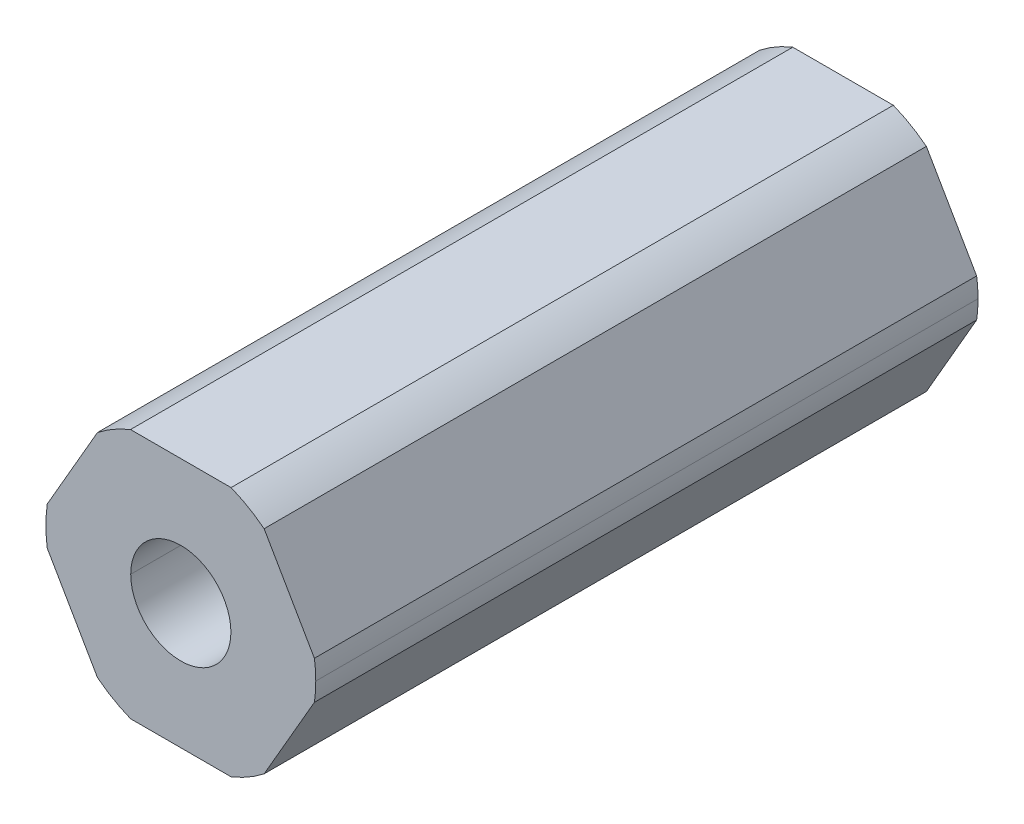
ISO-10303-21;
HEADER;
FILE_DESCRIPTION(('STEP AP214'),'2;1');
FILE_NAME('part.step','',(''),(''),'','','');
FILE_SCHEMA(('AUTOMOTIVE_DESIGN { 1 0 10303 214 1 1 1 1 }'));
ENDSEC;
DATA;
#1=APPLICATION_CONTEXT('core data for automotive mechanical design processes');
#2=APPLICATION_PROTOCOL_DEFINITION('international standard','automotive_design',2000,#1);
#3=PRODUCT_CONTEXT('',#1,'mechanical');
#4=PRODUCT('Part','Part','',(#3));
#5=PRODUCT_RELATED_PRODUCT_CATEGORY('part','',(#4));
#6=PRODUCT_DEFINITION_FORMATION('','',#4);
#7=PRODUCT_DEFINITION_CONTEXT('part definition',#1,'design');
#8=PRODUCT_DEFINITION('design','',#6,#7);
#9=PRODUCT_DEFINITION_SHAPE('','',#8);
#10=(LENGTH_UNIT() NAMED_UNIT(*) SI_UNIT(.MILLI.,.METRE.));
#11=(NAMED_UNIT(*) PLANE_ANGLE_UNIT() SI_UNIT($,.RADIAN.));
#12=(NAMED_UNIT(*) SI_UNIT($,.STERADIAN.) SOLID_ANGLE_UNIT());
#13=UNCERTAINTY_MEASURE_WITH_UNIT(LENGTH_MEASURE(1.E-05),#10,'distance_accuracy_value','');
#14=(GEOMETRIC_REPRESENTATION_CONTEXT(3) GLOBAL_UNCERTAINTY_ASSIGNED_CONTEXT((#13)) GLOBAL_UNIT_ASSIGNED_CONTEXT((#10,
#11,#12)) REPRESENTATION_CONTEXT('',''));
#15=CARTESIAN_POINT('',(0.,0.,0.));
#16=DIRECTION('',(0.,0.,1.));
#17=DIRECTION('',(1.,0.,0.));
#18=AXIS2_PLACEMENT_3D('',#15,#16,#17);
#19=CARTESIAN_POINT('',(0.,0.,-228.6));
#20=DIRECTION('',(0.,0.,1.));
#21=DIRECTION('',(1.,0.,0.));
#22=AXIS2_PLACEMENT_3D('',#19,#20,#21);
#23=CYLINDRICAL_SURFACE('',#22,2.55);
#24=DIRECTION('',(0.,0.,1.));
#25=VECTOR('',#24,1.);
#26=CARTESIAN_POINT('',(-2.55,0.,-228.6));
#27=LINE('',#26,#25);
#28=CARTESIAN_POINT('',(-2.55,0.,-228.6));
#29=VERTEX_POINT('',#28);
#30=CARTESIAN_POINT('',(-2.55,0.,-194.88785));
#31=VERTEX_POINT('',#30);
#32=EDGE_CURVE('E46',#29,#31,#27,.T.);
#33=ORIENTED_EDGE('',*,*,#32,.T.);
#34=CARTESIAN_POINT('',(0.,0.,-194.88785));
#35=DIRECTION('',(0.,0.,-1.));
#36=DIRECTION('',(-1.,0.,0.));
#37=AXIS2_PLACEMENT_3D('',#34,#35,#36);
#38=CIRCLE('',#37,2.55);
#39=CARTESIAN_POINT('',(2.55,0.,-194.88785));
#40=VERTEX_POINT('',#39);
#41=EDGE_CURVE('E60',#31,#40,#38,.F.);
#42=ORIENTED_EDGE('',*,*,#41,.T.);
#43=DIRECTION('',(0.,0.,1.));
#44=VECTOR('',#43,1.);
#45=CARTESIAN_POINT('',(2.55,0.,-228.6));
#46=LINE('',#45,#44);
#47=CARTESIAN_POINT('',(2.55,0.,-228.6));
#48=VERTEX_POINT('',#47);
#49=EDGE_CURVE('E192',#48,#40,#46,.T.);
#50=ORIENTED_EDGE('',*,*,#49,.F.);
#51=CARTESIAN_POINT('',(0.,0.,-228.6));
#52=DIRECTION('',(0.,0.,1.));
#53=DIRECTION('',(1.,0.,0.));
#54=AXIS2_PLACEMENT_3D('',#51,#52,#53);
#55=CIRCLE('',#54,2.55);
#56=EDGE_CURVE('E245',#29,#48,#55,.T.);
#57=ORIENTED_EDGE('',*,*,#56,.F.);
#58=EDGE_LOOP('',(#33,#42,#50,#57));
#59=FACE_BOUND('',#58,.T.);
#60=ADVANCED_FACE('F38',(#59),#23,.F.);
#61=CARTESIAN_POINT('',(0.,0.,-228.6));
#62=DIRECTION('',(0.,0.,1.));
#63=DIRECTION('',(1.,0.,0.));
#64=AXIS2_PLACEMENT_3D('',#61,#62,#63);
#65=CYLINDRICAL_SURFACE('',#64,6.87);
#66=CARTESIAN_POINT('',(0.,0.,-194.88785));
#67=DIRECTION('',(0.,0.,-1.));
#68=DIRECTION('',(-1.,0.,0.));
#69=AXIS2_PLACEMENT_3D('',#66,#67,#68);
#70=CIRCLE('',#69,6.87);
#71=CARTESIAN_POINT('',(6.80102150534208,-0.971085209378956,-194.88785));
#72=VERTEX_POINT('',#71);
#73=CARTESIAN_POINT('',(6.87,0.,-194.88785));
#74=VERTEX_POINT('',#73);
#75=EDGE_CURVE('E160',#72,#74,#70,.F.);
#76=ORIENTED_EDGE('',*,*,#75,.F.);
#77=DIRECTION('',(0.,0.,-1.));
#78=VECTOR('',#77,1.);
#79=CARTESIAN_POINT('',(6.80102150534208,-0.971085209378962,-228.6));
#80=LINE('',#79,#78);
#81=CARTESIAN_POINT('',(6.80102150534208,-0.971085209378955,-228.6));
#82=VERTEX_POINT('',#81);
#83=EDGE_CURVE('E173',#72,#82,#80,.T.);
#84=ORIENTED_EDGE('',*,*,#83,.T.);
#85=CARTESIAN_POINT('',(0.,0.,-228.6));
#86=DIRECTION('',(0.,0.,1.));
#87=DIRECTION('',(1.,0.,0.));
#88=AXIS2_PLACEMENT_3D('',#85,#86,#87);
#89=CIRCLE('',#88,6.87);
#90=CARTESIAN_POINT('',(6.87,0.,-228.6));
#91=VERTEX_POINT('',#90);
#92=EDGE_CURVE('E183',#82,#91,#89,.T.);
#93=ORIENTED_EDGE('',*,*,#92,.T.);
#94=DIRECTION('',(0.,0.,1.));
#95=VECTOR('',#94,1.);
#96=CARTESIAN_POINT('',(6.87,0.,-228.6));
#97=LINE('',#96,#95);
#98=EDGE_CURVE('E175',#91,#74,#97,.T.);
#99=ORIENTED_EDGE('',*,*,#98,.T.);
#100=EDGE_LOOP('',(#76,#84,#93,#99));
#101=FACE_BOUND('',#100,.T.);
#102=ADVANCED_FACE('F171',(#101),#65,.T.);
#103=CARTESIAN_POINT('',(3.68083890619154,-6.3754,228.6));
#104=DIRECTION('',(-0.866025403784439,0.5,0.));
#105=DIRECTION('',(0.,0.,1.));
#106=AXIS2_PLACEMENT_3D('',#103,#104,#105);
#107=PLANE('',#106);
#108=ORIENTED_EDGE('',*,*,#83,.F.);
#109=DIRECTION('',(0.500000000000001,0.866025403784438,0.));
#110=VECTOR('',#109,1.);
#111=CARTESIAN_POINT('',(4.24149521323254,-5.40431479062105,-194.88785));
#112=LINE('',#111,#110);
#113=CARTESIAN_POINT('',(4.24149521323254,-5.40431479062105,-194.88785));
#114=VERTEX_POINT('',#113);
#115=EDGE_CURVE('E157',#114,#72,#112,.T.);
#116=ORIENTED_EDGE('',*,*,#115,.F.);
#117=DIRECTION('',(0.,0.,1.));
#118=VECTOR('',#117,1.);
#119=CARTESIAN_POINT('',(4.24149521323255,-5.40431479062104,-228.6));
#120=LINE('',#119,#118);
#121=CARTESIAN_POINT('',(4.24149521323254,-5.40431479062105,-228.6));
#122=VERTEX_POINT('',#121);
#123=EDGE_CURVE('E244',#122,#114,#120,.T.);
#124=ORIENTED_EDGE('',*,*,#123,.F.);
#125=DIRECTION('',(0.5,0.866025403784439,0.));
#126=VECTOR('',#125,1.);
#127=CARTESIAN_POINT('',(3.68083890619154,-6.3754,-228.6));
#128=LINE('',#127,#126);
#129=EDGE_CURVE('E180',#122,#82,#128,.T.);
#130=ORIENTED_EDGE('',*,*,#129,.T.);
#131=EDGE_LOOP('',(#108,#116,#124,#130));
#132=FACE_BOUND('',#131,.T.);
#133=ADVANCED_FACE('F178',(#132),#107,.F.);
#134=CARTESIAN_POINT('',(7.36167781238308,0.,228.6));
#135=DIRECTION('',(-0.866025403784439,-0.5,0.));
#136=DIRECTION('',(-0.5,0.866025403784439,0.));
#137=AXIS2_PLACEMENT_3D('',#134,#135,#136);
#138=PLANE('',#137);
#139=DIRECTION('',(0.,0.,-1.));
#140=VECTOR('',#139,1.);
#141=CARTESIAN_POINT('',(4.24149521323254,5.40431479062105,-228.6));
#142=LINE('',#141,#140);
#143=CARTESIAN_POINT('',(4.24149521323254,5.40431479062105,-194.88785));
#144=VERTEX_POINT('',#143);
#145=CARTESIAN_POINT('',(4.24149521323254,5.40431479062105,-228.6));
#146=VERTEX_POINT('',#145);
#147=EDGE_CURVE('E211',#144,#146,#142,.T.);
#148=ORIENTED_EDGE('',*,*,#147,.F.);
#149=DIRECTION('',(-0.5,0.866025403784439,0.));
#150=VECTOR('',#149,1.);
#151=CARTESIAN_POINT('',(6.80102150534208,0.97108520937895,-194.88785));
#152=LINE('',#151,#150);
#153=CARTESIAN_POINT('',(6.80102150534208,0.97108520937895,-194.88785));
#154=VERTEX_POINT('',#153);
#155=EDGE_CURVE('E53',#154,#144,#152,.T.);
#156=ORIENTED_EDGE('',*,*,#155,.F.);
#157=DIRECTION('',(0.,0.,1.));
#158=VECTOR('',#157,1.);
#159=CARTESIAN_POINT('',(6.80102150534208,0.971085209378949,-228.6));
#160=LINE('',#159,#158);
#161=CARTESIAN_POINT('',(6.80102150534208,0.97108520937895,-228.6));
#162=VERTEX_POINT('',#161);
#163=EDGE_CURVE('E239',#162,#154,#160,.T.);
#164=ORIENTED_EDGE('',*,*,#163,.F.);
#165=DIRECTION('',(-0.5,0.866025403784439,0.));
#166=VECTOR('',#165,1.);
#167=CARTESIAN_POINT('',(7.36167781238308,0.,-228.6));
#168=LINE('',#167,#166);
#169=EDGE_CURVE('E186',#162,#146,#168,.T.);
#170=ORIENTED_EDGE('',*,*,#169,.T.);
#171=EDGE_LOOP('',(#148,#156,#164,#170));
#172=FACE_BOUND('',#171,.T.);
#173=ADVANCED_FACE('F361',(#172),#138,.F.);
#174=CARTESIAN_POINT('',(3.68083890619154,6.3754,228.6));
#175=DIRECTION('',(0.,-1.,0.));
#176=DIRECTION('',(0.,0.,-1.));
#177=AXIS2_PLACEMENT_3D('',#174,#175,#176);
#178=PLANE('',#177);
#179=DIRECTION('',(0.,0.,-1.));
#180=VECTOR('',#179,1.);
#181=CARTESIAN_POINT('',(-2.55952629210953,6.3754,-228.6));
#182=LINE('',#181,#180);
#183=CARTESIAN_POINT('',(-2.55952629210953,6.3754,-194.88785));
#184=VERTEX_POINT('',#183);
#185=CARTESIAN_POINT('',(-2.55952629210953,6.3754,-228.6));
#186=VERTEX_POINT('',#185);
#187=EDGE_CURVE('E209',#184,#186,#182,.T.);
#188=ORIENTED_EDGE('',*,*,#187,.F.);
#189=DIRECTION('',(-1.,0.,0.));
#190=VECTOR('',#189,1.);
#191=CARTESIAN_POINT('',(2.55952629210953,6.3754,-194.88785));
#192=LINE('',#191,#190);
#193=CARTESIAN_POINT('',(2.55952629210953,6.3754,-194.88785));
#194=VERTEX_POINT('',#193);
#195=EDGE_CURVE('E314',#194,#184,#192,.T.);
#196=ORIENTED_EDGE('',*,*,#195,.F.);
#197=DIRECTION('',(0.,0.,1.));
#198=VECTOR('',#197,1.);
#199=CARTESIAN_POINT('',(2.55952629210952,6.3754,-228.6));
#200=LINE('',#199,#198);
#201=CARTESIAN_POINT('',(2.55952629210952,6.3754,-228.6));
#202=VERTEX_POINT('',#201);
#203=EDGE_CURVE('E196',#202,#194,#200,.T.);
#204=ORIENTED_EDGE('',*,*,#203,.F.);
#205=DIRECTION('',(-1.,0.,0.));
#206=VECTOR('',#205,1.);
#207=CARTESIAN_POINT('',(3.68083890619154,6.3754,-228.6));
#208=LINE('',#207,#206);
#209=EDGE_CURVE('E202',#202,#186,#208,.T.);
#210=ORIENTED_EDGE('',*,*,#209,.T.);
#211=EDGE_LOOP('',(#188,#196,#204,#210));
#212=FACE_BOUND('',#211,.T.);
#213=ADVANCED_FACE('F334',(#212),#178,.F.);
#214=CARTESIAN_POINT('',(-3.68083890619154,6.3754,228.6));
#215=DIRECTION('',(0.866025403784439,-0.5,0.));
#216=DIRECTION('',(0.,0.,-1.));
#217=AXIS2_PLACEMENT_3D('',#214,#215,#216);
#218=PLANE('',#217);
#219=DIRECTION('',(0.,0.,-1.));
#220=VECTOR('',#219,1.);
#221=CARTESIAN_POINT('',(-6.80102150534208,0.97108520937896,-228.6));
#222=LINE('',#221,#220);
#223=CARTESIAN_POINT('',(-6.80102150534208,0.97108520937896,-194.88785));
#224=VERTEX_POINT('',#223);
#225=CARTESIAN_POINT('',(-6.80102150534208,0.97108520937896,-228.6));
#226=VERTEX_POINT('',#225);
#227=EDGE_CURVE('E255',#224,#226,#222,.T.);
#228=ORIENTED_EDGE('',*,*,#227,.F.);
#229=DIRECTION('',(-0.5,-0.866025403784438,0.));
#230=VECTOR('',#229,1.);
#231=CARTESIAN_POINT('',(-4.24149521323255,5.40431479062105,-194.88785));
#232=LINE('',#231,#230);
#233=CARTESIAN_POINT('',(-4.24149521323254,5.40431479062105,-194.88785));
#234=VERTEX_POINT('',#233);
#235=EDGE_CURVE('E310',#234,#224,#232,.T.);
#236=ORIENTED_EDGE('',*,*,#235,.F.);
#237=DIRECTION('',(0.,0.,1.));
#238=VECTOR('',#237,1.);
#239=CARTESIAN_POINT('',(-4.24149521323255,5.40431479062105,-228.6));
#240=LINE('',#239,#238);
#241=CARTESIAN_POINT('',(-4.24149521323255,5.40431479062105,-228.6));
#242=VERTEX_POINT('',#241);
#243=EDGE_CURVE('E210',#242,#234,#240,.T.);
#244=ORIENTED_EDGE('',*,*,#243,.F.);
#245=DIRECTION('',(-0.5,-0.866025403784439,0.));
#246=VECTOR('',#245,1.);
#247=CARTESIAN_POINT('',(-3.68083890619154,6.3754,-228.6));
#248=LINE('',#247,#246);
#249=EDGE_CURVE('E199',#242,#226,#248,.T.);
#250=ORIENTED_EDGE('',*,*,#249,.T.);
#251=EDGE_LOOP('',(#228,#236,#244,#250));
#252=FACE_BOUND('',#251,.T.);
#253=ADVANCED_FACE('F372',(#252),#218,.F.);
#254=CARTESIAN_POINT('',(-7.36167781238308,0.,228.6));
#255=DIRECTION('',(0.866025403784439,0.5,0.));
#256=DIRECTION('',(0.,0.,-1.));
#257=AXIS2_PLACEMENT_3D('',#254,#255,#256);
#258=PLANE('',#257);
#259=DIRECTION('',(0.,0.,-1.));
#260=VECTOR('',#259,1.);
#261=CARTESIAN_POINT('',(-4.24149521323255,-5.40431479062104,-228.6));
#262=LINE('',#261,#260);
#263=CARTESIAN_POINT('',(-4.24149521323255,-5.40431479062105,-194.88785));
#264=VERTEX_POINT('',#263);
#265=CARTESIAN_POINT('',(-4.24149521323254,-5.40431479062105,-228.6));
#266=VERTEX_POINT('',#265);
#267=EDGE_CURVE('E238',#264,#266,#262,.T.);
#268=ORIENTED_EDGE('',*,*,#267,.F.);
#269=DIRECTION('',(0.5,-0.866025403784439,0.));
#270=VECTOR('',#269,1.);
#271=CARTESIAN_POINT('',(-6.80102150534208,-0.971085209378954,-194.88785));
#272=LINE('',#271,#270);
#273=CARTESIAN_POINT('',(-6.80102150534208,-0.971085209378951,-194.88785));
#274=VERTEX_POINT('',#273);
#275=EDGE_CURVE('E304',#274,#264,#272,.T.);
#276=ORIENTED_EDGE('',*,*,#275,.F.);
#277=DIRECTION('',(0.,0.,1.));
#278=VECTOR('',#277,1.);
#279=CARTESIAN_POINT('',(-6.80102150534208,-0.971085209378962,-228.6));
#280=LINE('',#279,#278);
#281=CARTESIAN_POINT('',(-6.80102150534208,-0.971085209378956,-228.6));
#282=VERTEX_POINT('',#281);
#283=EDGE_CURVE('E217',#282,#274,#280,.T.);
#284=ORIENTED_EDGE('',*,*,#283,.F.);
#285=DIRECTION('',(0.5,-0.866025403784439,0.));
#286=VECTOR('',#285,1.);
#287=CARTESIAN_POINT('',(-7.36167781238308,0.,-228.6));
#288=LINE('',#287,#286);
#289=EDGE_CURVE('E203',#282,#266,#288,.T.);
#290=ORIENTED_EDGE('',*,*,#289,.T.);
#291=EDGE_LOOP('',(#268,#276,#284,#290));
#292=FACE_BOUND('',#291,.T.);
#293=ADVANCED_FACE('F288',(#292),#258,.F.);
#294=CARTESIAN_POINT('',(-3.68083890619154,-6.3754,228.6));
#295=DIRECTION('',(0.,1.,0.));
#296=DIRECTION('',(1.,0.,0.));
#297=AXIS2_PLACEMENT_3D('',#294,#295,#296);
#298=PLANE('',#297);
#299=DIRECTION('',(0.,0.,-1.));
#300=VECTOR('',#299,1.);
#301=CARTESIAN_POINT('',(2.55952629210953,-6.3754,-228.6));
#302=LINE('',#301,#300);
#303=CARTESIAN_POINT('',(2.55952629210953,-6.3754,-194.88785));
#304=VERTEX_POINT('',#303);
#305=CARTESIAN_POINT('',(2.55952629210953,-6.3754,-228.6));
#306=VERTEX_POINT('',#305);
#307=EDGE_CURVE('E237',#304,#306,#302,.T.);
#308=ORIENTED_EDGE('',*,*,#307,.F.);
#309=DIRECTION('',(1.,0.,0.));
#310=VECTOR('',#309,1.);
#311=CARTESIAN_POINT('',(-2.55952629210953,-6.3754,-194.88785));
#312=LINE('',#311,#310);
#313=CARTESIAN_POINT('',(-2.55952629210953,-6.37540000000001,-194.88785));
#314=VERTEX_POINT('',#313);
#315=EDGE_CURVE('E301',#314,#304,#312,.T.);
#316=ORIENTED_EDGE('',*,*,#315,.F.);
#317=DIRECTION('',(0.,0.,1.));
#318=VECTOR('',#317,1.);
#319=CARTESIAN_POINT('',(-2.55952629210953,-6.3754,-228.6));
#320=LINE('',#319,#318);
#321=CARTESIAN_POINT('',(-2.55952629210953,-6.3754,-228.6));
#322=VERTEX_POINT('',#321);
#323=EDGE_CURVE('E257',#322,#314,#320,.T.);
#324=ORIENTED_EDGE('',*,*,#323,.F.);
#325=DIRECTION('',(1.,0.,0.));
#326=VECTOR('',#325,1.);
#327=CARTESIAN_POINT('',(-3.68083890619154,-6.3754,-228.6));
#328=LINE('',#327,#326);
#329=EDGE_CURVE('E268',#322,#306,#328,.T.);
#330=ORIENTED_EDGE('',*,*,#329,.T.);
#331=EDGE_LOOP('',(#308,#316,#324,#330));
#332=FACE_BOUND('',#331,.T.);
#333=ADVANCED_FACE('F299',(#332),#298,.F.);
#334=CARTESIAN_POINT('',(0.,0.,-228.6));
#335=DIRECTION('',(0.,0.,1.));
#336=DIRECTION('',(1.,0.,0.));
#337=AXIS2_PLACEMENT_3D('',#334,#335,#336);
#338=PLANE('',#337);
#339=CARTESIAN_POINT('',(0.,0.,-228.6));
#340=DIRECTION('',(0.,0.,1.));
#341=DIRECTION('',(1.,0.,0.));
#342=AXIS2_PLACEMENT_3D('',#339,#340,#341);
#343=CIRCLE('',#342,6.87);
#344=EDGE_CURVE('E213',#146,#202,#343,.T.);
#345=ORIENTED_EDGE('',*,*,#344,.F.);
#346=ORIENTED_EDGE('',*,*,#169,.F.);
#347=CARTESIAN_POINT('',(0.,0.,-228.6));
#348=DIRECTION('',(0.,0.,1.));
#349=DIRECTION('',(1.,0.,0.));
#350=AXIS2_PLACEMENT_3D('',#347,#348,#349);
#351=CIRCLE('',#350,6.87);
#352=EDGE_CURVE('E243',#91,#162,#351,.T.);
#353=ORIENTED_EDGE('',*,*,#352,.F.);
#354=ORIENTED_EDGE('',*,*,#92,.F.);
#355=ORIENTED_EDGE('',*,*,#129,.F.);
#356=CARTESIAN_POINT('',(0.,0.,-228.6));
#357=DIRECTION('',(0.,0.,1.));
#358=DIRECTION('',(1.,0.,0.));
#359=AXIS2_PLACEMENT_3D('',#356,#357,#358);
#360=CIRCLE('',#359,6.87);
#361=EDGE_CURVE('E233',#306,#122,#360,.T.);
#362=ORIENTED_EDGE('',*,*,#361,.F.);
#363=ORIENTED_EDGE('',*,*,#329,.F.);
#364=CARTESIAN_POINT('',(0.,0.,-228.6));
#365=DIRECTION('',(0.,0.,1.));
#366=DIRECTION('',(1.,0.,0.));
#367=AXIS2_PLACEMENT_3D('',#364,#365,#366);
#368=CIRCLE('',#367,6.87);
#369=EDGE_CURVE('E264',#266,#322,#368,.T.);
#370=ORIENTED_EDGE('',*,*,#369,.F.);
#371=ORIENTED_EDGE('',*,*,#289,.F.);
#372=CARTESIAN_POINT('',(0.,0.,-228.6));
#373=DIRECTION('',(0.,0.,1.));
#374=DIRECTION('',(1.,0.,0.));
#375=AXIS2_PLACEMENT_3D('',#372,#373,#374);
#376=CIRCLE('',#375,6.87);
#377=EDGE_CURVE('E258',#226,#282,#376,.T.);
#378=ORIENTED_EDGE('',*,*,#377,.F.);
#379=ORIENTED_EDGE('',*,*,#249,.F.);
#380=CARTESIAN_POINT('',(0.,0.,-228.6));
#381=DIRECTION('',(0.,0.,1.));
#382=DIRECTION('',(1.,0.,0.));
#383=AXIS2_PLACEMENT_3D('',#380,#381,#382);
#384=CIRCLE('',#383,6.87);
#385=EDGE_CURVE('E205',#186,#242,#384,.T.);
#386=ORIENTED_EDGE('',*,*,#385,.F.);
#387=ORIENTED_EDGE('',*,*,#209,.F.);
#388=EDGE_LOOP('',(#345,#346,#353,#354,#355,#362,#363,#370,#371,#378,#379,#386,#387));
#389=FACE_BOUND('',#388,.T.);
#390=CARTESIAN_POINT('',(0.,0.,-228.6));
#391=DIRECTION('',(0.,0.,1.));
#392=DIRECTION('',(1.,0.,0.));
#393=AXIS2_PLACEMENT_3D('',#390,#391,#392);
#394=CIRCLE('',#393,2.55);
#395=EDGE_CURVE('E190',#48,#29,#394,.T.);
#396=ORIENTED_EDGE('',*,*,#395,.T.);
#397=ORIENTED_EDGE('',*,*,#56,.T.);
#398=EDGE_LOOP('',(#396,#397));
#399=FACE_BOUND('',#398,.T.);
#400=ADVANCED_FACE('F40',(#389,#399),#338,.F.);
#401=CARTESIAN_POINT('',(0.,0.,-228.6));
#402=DIRECTION('',(0.,0.,1.));
#403=DIRECTION('',(1.,0.,0.));
#404=AXIS2_PLACEMENT_3D('',#401,#402,#403);
#405=CYLINDRICAL_SURFACE('',#404,6.87);
#406=EDGE_CURVE('E167',#74,#154,#70,.F.);
#407=ORIENTED_EDGE('',*,*,#406,.F.);
#408=ORIENTED_EDGE('',*,*,#98,.F.);
#409=ORIENTED_EDGE('',*,*,#352,.T.);
#410=ORIENTED_EDGE('',*,*,#163,.T.);
#411=EDGE_LOOP('',(#407,#408,#409,#410));
#412=FACE_BOUND('',#411,.T.);
#413=ADVANCED_FACE('F340',(#412),#405,.T.);
#414=CARTESIAN_POINT('',(0.,0.,-228.6));
#415=DIRECTION('',(0.,0.,1.));
#416=DIRECTION('',(1.,0.,0.));
#417=AXIS2_PLACEMENT_3D('',#414,#415,#416);
#418=CYLINDRICAL_SURFACE('',#417,6.87);
#419=CARTESIAN_POINT('',(0.,0.,-194.88785));
#420=DIRECTION('',(0.,0.,-1.));
#421=DIRECTION('',(-1.,0.,0.));
#422=AXIS2_PLACEMENT_3D('',#419,#420,#421);
#423=CIRCLE('',#422,6.87);
#424=EDGE_CURVE('E163',#304,#114,#423,.F.);
#425=ORIENTED_EDGE('',*,*,#424,.F.);
#426=ORIENTED_EDGE('',*,*,#307,.T.);
#427=ORIENTED_EDGE('',*,*,#361,.T.);
#428=ORIENTED_EDGE('',*,*,#123,.T.);
#429=EDGE_LOOP('',(#425,#426,#427,#428));
#430=FACE_BOUND('',#429,.T.);
#431=ADVANCED_FACE('F342',(#430),#418,.T.);
#432=CARTESIAN_POINT('',(0.,0.,-228.6));
#433=DIRECTION('',(0.,0.,1.));
#434=DIRECTION('',(1.,0.,0.));
#435=AXIS2_PLACEMENT_3D('',#432,#433,#434);
#436=CYLINDRICAL_SURFACE('',#435,6.87);
#437=CARTESIAN_POINT('',(0.,0.,-194.88785));
#438=DIRECTION('',(0.,0.,-1.));
#439=DIRECTION('',(-1.,0.,0.));
#440=AXIS2_PLACEMENT_3D('',#437,#438,#439);
#441=CIRCLE('',#440,6.87);
#442=EDGE_CURVE('E284',#264,#314,#441,.F.);
#443=ORIENTED_EDGE('',*,*,#442,.F.);
#444=ORIENTED_EDGE('',*,*,#267,.T.);
#445=ORIENTED_EDGE('',*,*,#369,.T.);
#446=ORIENTED_EDGE('',*,*,#323,.T.);
#447=EDGE_LOOP('',(#443,#444,#445,#446));
#448=FACE_BOUND('',#447,.T.);
#449=ADVANCED_FACE('F282',(#448),#436,.T.);
#450=CARTESIAN_POINT('',(0.,0.,-228.6));
#451=DIRECTION('',(0.,0.,1.));
#452=DIRECTION('',(1.,0.,0.));
#453=AXIS2_PLACEMENT_3D('',#450,#451,#452);
#454=CYLINDRICAL_SURFACE('',#453,6.87);
#455=CARTESIAN_POINT('',(0.,0.,-194.88785));
#456=DIRECTION('',(0.,0.,-1.));
#457=DIRECTION('',(-1.,0.,0.));
#458=AXIS2_PLACEMENT_3D('',#455,#456,#457);
#459=CIRCLE('',#458,6.87);
#460=EDGE_CURVE('E308',#224,#274,#459,.F.);
#461=ORIENTED_EDGE('',*,*,#460,.F.);
#462=ORIENTED_EDGE('',*,*,#227,.T.);
#463=ORIENTED_EDGE('',*,*,#377,.T.);
#464=ORIENTED_EDGE('',*,*,#283,.T.);
#465=EDGE_LOOP('',(#461,#462,#463,#464));
#466=FACE_BOUND('',#465,.T.);
#467=ADVANCED_FACE('F322',(#466),#454,.T.);
#468=CARTESIAN_POINT('',(0.,0.,-228.6));
#469=DIRECTION('',(0.,0.,1.));
#470=DIRECTION('',(1.,0.,0.));
#471=AXIS2_PLACEMENT_3D('',#468,#469,#470);
#472=CYLINDRICAL_SURFACE('',#471,6.87);
#473=CARTESIAN_POINT('',(0.,0.,-194.88785));
#474=DIRECTION('',(0.,0.,-1.));
#475=DIRECTION('',(-1.,0.,0.));
#476=AXIS2_PLACEMENT_3D('',#473,#474,#475);
#477=CIRCLE('',#476,6.87);
#478=EDGE_CURVE('E312',#184,#234,#477,.F.);
#479=ORIENTED_EDGE('',*,*,#478,.F.);
#480=ORIENTED_EDGE('',*,*,#187,.T.);
#481=ORIENTED_EDGE('',*,*,#385,.T.);
#482=ORIENTED_EDGE('',*,*,#243,.T.);
#483=EDGE_LOOP('',(#479,#480,#481,#482));
#484=FACE_BOUND('',#483,.T.);
#485=ADVANCED_FACE('F330',(#484),#472,.T.);
#486=CARTESIAN_POINT('',(0.,0.,-228.6));
#487=DIRECTION('',(0.,0.,1.));
#488=DIRECTION('',(1.,0.,0.));
#489=AXIS2_PLACEMENT_3D('',#486,#487,#488);
#490=CYLINDRICAL_SURFACE('',#489,6.87);
#491=CARTESIAN_POINT('',(0.,0.,-194.88785));
#492=DIRECTION('',(0.,0.,-1.));
#493=DIRECTION('',(-1.,0.,0.));
#494=AXIS2_PLACEMENT_3D('',#491,#492,#493);
#495=CIRCLE('',#494,6.87);
#496=EDGE_CURVE('E316',#144,#194,#495,.F.);
#497=ORIENTED_EDGE('',*,*,#496,.F.);
#498=ORIENTED_EDGE('',*,*,#147,.T.);
#499=ORIENTED_EDGE('',*,*,#344,.T.);
#500=ORIENTED_EDGE('',*,*,#203,.T.);
#501=EDGE_LOOP('',(#497,#498,#499,#500));
#502=FACE_BOUND('',#501,.T.);
#503=ADVANCED_FACE('F365',(#502),#490,.T.);
#504=CARTESIAN_POINT('',(0.,0.,-228.6));
#505=DIRECTION('',(0.,0.,1.));
#506=DIRECTION('',(1.,0.,0.));
#507=AXIS2_PLACEMENT_3D('',#504,#505,#506);
#508=CYLINDRICAL_SURFACE('',#507,2.55);
#509=ORIENTED_EDGE('',*,*,#49,.T.);
#510=CARTESIAN_POINT('',(0.,0.,-194.88785));
#511=DIRECTION('',(0.,0.,-1.));
#512=DIRECTION('',(-1.,0.,0.));
#513=AXIS2_PLACEMENT_3D('',#510,#511,#512);
#514=CIRCLE('',#513,2.55);
#515=EDGE_CURVE('E11',#40,#31,#514,.F.);
#516=ORIENTED_EDGE('',*,*,#515,.T.);
#517=ORIENTED_EDGE('',*,*,#32,.F.);
#518=ORIENTED_EDGE('',*,*,#395,.F.);
#519=EDGE_LOOP('',(#509,#516,#517,#518));
#520=FACE_BOUND('',#519,.T.);
#521=ADVANCED_FACE('F366',(#520),#508,.F.);
#522=CARTESIAN_POINT('',(-108.727158944998,-36.0185983099119,-194.88785));
#523=DIRECTION('',(0.,0.,-1.));
#524=DIRECTION('',(-0.926669174308986,0.375877960760542,0.));
#525=AXIS2_PLACEMENT_3D('',#522,#523,#524);
#526=PLANE('',#525);
#527=ORIENTED_EDGE('',*,*,#75,.T.);
#528=ORIENTED_EDGE('',*,*,#406,.T.);
#529=ORIENTED_EDGE('',*,*,#155,.T.);
#530=ORIENTED_EDGE('',*,*,#496,.T.);
#531=ORIENTED_EDGE('',*,*,#195,.T.);
#532=ORIENTED_EDGE('',*,*,#478,.T.);
#533=ORIENTED_EDGE('',*,*,#235,.T.);
#534=ORIENTED_EDGE('',*,*,#460,.T.);
#535=ORIENTED_EDGE('',*,*,#275,.T.);
#536=ORIENTED_EDGE('',*,*,#442,.T.);
#537=ORIENTED_EDGE('',*,*,#315,.T.);
#538=ORIENTED_EDGE('',*,*,#424,.T.);
#539=ORIENTED_EDGE('',*,*,#115,.T.);
#540=EDGE_LOOP('',(#527,#528,#529,#530,#531,#532,#533,#534,#535,#536,#537,#538,#539));
#541=FACE_BOUND('',#540,.T.);
#542=ORIENTED_EDGE('',*,*,#515,.F.);
#543=ORIENTED_EDGE('',*,*,#41,.F.);
#544=EDGE_LOOP('',(#542,#543));
#545=FACE_BOUND('',#544,.T.);
#546=ADVANCED_FACE('F159',(#541,#545),#526,.F.);
#547=CLOSED_SHELL('',(#60,#102,#133,#173,#213,#253,#293,#333,#400,#413,#431,#449,#467,#485,#503,
#521,#546));
#548=MANIFOLD_SOLID_BREP('B2',#547);
#549=ADVANCED_BREP_SHAPE_REPRESENTATION('',(#18,#548),#14);
#550=SHAPE_DEFINITION_REPRESENTATION(#9,#549);
ENDSEC;
END-ISO-10303-21;
